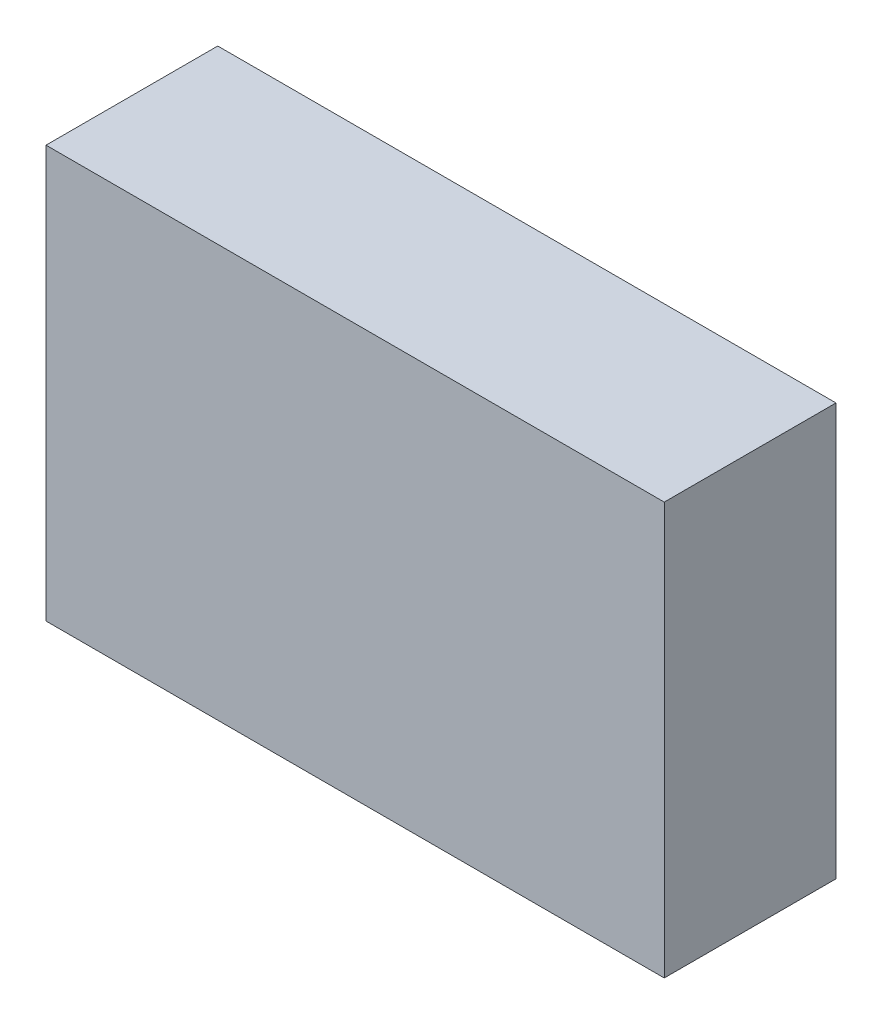
ISO-10303-21;
HEADER;
FILE_DESCRIPTION(('STEP AP214'),'2;1');
FILE_NAME('part.step','',(''),(''),'','','');
FILE_SCHEMA(('AUTOMOTIVE_DESIGN { 1 0 10303 214 1 1 1 1 }'));
ENDSEC;
DATA;
#1=APPLICATION_CONTEXT('core data for automotive mechanical design processes');
#2=APPLICATION_PROTOCOL_DEFINITION('international standard','automotive_design',2000,#1);
#3=PRODUCT_CONTEXT('',#1,'mechanical');
#4=PRODUCT('Part','Part','',(#3));
#5=PRODUCT_RELATED_PRODUCT_CATEGORY('part','',(#4));
#6=PRODUCT_DEFINITION_FORMATION('','',#4);
#7=PRODUCT_DEFINITION_CONTEXT('part definition',#1,'design');
#8=PRODUCT_DEFINITION('design','',#6,#7);
#9=PRODUCT_DEFINITION_SHAPE('','',#8);
#10=(LENGTH_UNIT() NAMED_UNIT(*) SI_UNIT(.MILLI.,.METRE.));
#11=(NAMED_UNIT(*) PLANE_ANGLE_UNIT() SI_UNIT($,.RADIAN.));
#12=(NAMED_UNIT(*) SI_UNIT($,.STERADIAN.) SOLID_ANGLE_UNIT());
#13=UNCERTAINTY_MEASURE_WITH_UNIT(LENGTH_MEASURE(1.E-05),#10,'distance_accuracy_value','');
#14=(GEOMETRIC_REPRESENTATION_CONTEXT(3) GLOBAL_UNCERTAINTY_ASSIGNED_CONTEXT((#13)) GLOBAL_UNIT_ASSIGNED_CONTEXT((#10,
#11,#12)) REPRESENTATION_CONTEXT('',''));
#15=CARTESIAN_POINT('',(0.,0.,0.));
#16=DIRECTION('',(0.,0.,1.));
#17=DIRECTION('',(1.,0.,0.));
#18=AXIS2_PLACEMENT_3D('',#15,#16,#17);
#19=CARTESIAN_POINT('',(0.,0.,25.));
#20=DIRECTION('',(1.,0.,0.));
#21=DIRECTION('',(0.,0.,-1.));
#22=AXIS2_PLACEMENT_3D('',#19,#20,#21);
#23=PLANE('',#22);
#24=DIRECTION('',(0.,-1.,0.));
#25=VECTOR('',#24,1.);
#26=CARTESIAN_POINT('',(0.,0.,0.));
#27=LINE('',#26,#25);
#28=CARTESIAN_POINT('',(0.,60.,0.));
#29=VERTEX_POINT('',#28);
#30=CARTESIAN_POINT('',(0.,0.,0.));
#31=VERTEX_POINT('',#30);
#32=EDGE_CURVE('E117',#29,#31,#27,.T.);
#33=ORIENTED_EDGE('',*,*,#32,.T.);
#34=DIRECTION('',(0.,0.,-1.));
#35=VECTOR('',#34,1.);
#36=CARTESIAN_POINT('',(0.,0.,25.));
#37=LINE('',#36,#35);
#38=CARTESIAN_POINT('',(0.,0.,25.));
#39=VERTEX_POINT('',#38);
#40=EDGE_CURVE('E11',#39,#31,#37,.T.);
#41=ORIENTED_EDGE('',*,*,#40,.F.);
#42=DIRECTION('',(0.,-1.,0.));
#43=VECTOR('',#42,1.);
#44=CARTESIAN_POINT('',(0.,0.,25.));
#45=LINE('',#44,#43);
#46=CARTESIAN_POINT('',(0.,60.,25.));
#47=VERTEX_POINT('',#46);
#48=EDGE_CURVE('E101',#47,#39,#45,.T.);
#49=ORIENTED_EDGE('',*,*,#48,.F.);
#50=DIRECTION('',(0.,0.,-1.));
#51=VECTOR('',#50,1.);
#52=CARTESIAN_POINT('',(0.,60.,25.));
#53=LINE('',#52,#51);
#54=EDGE_CURVE('E113',#47,#29,#53,.T.);
#55=ORIENTED_EDGE('',*,*,#54,.T.);
#56=EDGE_LOOP('',(#33,#41,#49,#55));
#57=FACE_BOUND('',#56,.T.);
#58=ADVANCED_FACE('F49',(#57),#23,.F.);
#59=CARTESIAN_POINT('',(0.,0.,25.));
#60=DIRECTION('',(0.,1.,0.));
#61=DIRECTION('',(0.,0.,1.));
#62=AXIS2_PLACEMENT_3D('',#59,#60,#61);
#63=PLANE('',#62);
#64=DIRECTION('',(1.,0.,0.));
#65=VECTOR('',#64,1.);
#66=CARTESIAN_POINT('',(0.,0.,0.));
#67=LINE('',#66,#65);
#68=CARTESIAN_POINT('',(90.,0.,0.));
#69=VERTEX_POINT('',#68);
#70=EDGE_CURVE('E106',#31,#69,#67,.T.);
#71=ORIENTED_EDGE('',*,*,#70,.T.);
#72=DIRECTION('',(0.,0.,-1.));
#73=VECTOR('',#72,1.);
#74=CARTESIAN_POINT('',(90.,0.,25.));
#75=LINE('',#74,#73);
#76=CARTESIAN_POINT('',(90.,0.,25.));
#77=VERTEX_POINT('',#76);
#78=EDGE_CURVE('E58',#77,#69,#75,.T.);
#79=ORIENTED_EDGE('',*,*,#78,.F.);
#80=DIRECTION('',(1.,0.,0.));
#81=VECTOR('',#80,1.);
#82=CARTESIAN_POINT('',(0.,0.,25.));
#83=LINE('',#82,#81);
#84=EDGE_CURVE('E96',#39,#77,#83,.T.);
#85=ORIENTED_EDGE('',*,*,#84,.F.);
#86=ORIENTED_EDGE('',*,*,#40,.T.);
#87=EDGE_LOOP('',(#71,#79,#85,#86));
#88=FACE_BOUND('',#87,.T.);
#89=ADVANCED_FACE('F105',(#88),#63,.F.);
#90=CARTESIAN_POINT('',(90.,0.,25.));
#91=DIRECTION('',(-1.,0.,0.));
#92=DIRECTION('',(0.,0.,1.));
#93=AXIS2_PLACEMENT_3D('',#90,#91,#92);
#94=PLANE('',#93);
#95=DIRECTION('',(0.,1.,0.));
#96=VECTOR('',#95,1.);
#97=CARTESIAN_POINT('',(90.,0.,0.));
#98=LINE('',#97,#96);
#99=CARTESIAN_POINT('',(90.,60.,0.));
#100=VERTEX_POINT('',#99);
#101=EDGE_CURVE('E83',#69,#100,#98,.T.);
#102=ORIENTED_EDGE('',*,*,#101,.T.);
#103=DIRECTION('',(0.,0.,-1.));
#104=VECTOR('',#103,1.);
#105=CARTESIAN_POINT('',(90.,60.,25.));
#106=LINE('',#105,#104);
#107=CARTESIAN_POINT('',(90.,60.,25.));
#108=VERTEX_POINT('',#107);
#109=EDGE_CURVE('E108',#108,#100,#106,.T.);
#110=ORIENTED_EDGE('',*,*,#109,.F.);
#111=DIRECTION('',(0.,1.,0.));
#112=VECTOR('',#111,1.);
#113=CARTESIAN_POINT('',(90.,0.,25.));
#114=LINE('',#113,#112);
#115=EDGE_CURVE('E99',#77,#108,#114,.T.);
#116=ORIENTED_EDGE('',*,*,#115,.F.);
#117=ORIENTED_EDGE('',*,*,#78,.T.);
#118=EDGE_LOOP('',(#102,#110,#116,#117));
#119=FACE_BOUND('',#118,.T.);
#120=ADVANCED_FACE('F109',(#119),#94,.F.);
#121=CARTESIAN_POINT('',(0.,60.,25.));
#122=DIRECTION('',(0.,-1.,0.));
#123=DIRECTION('',(0.,0.,-1.));
#124=AXIS2_PLACEMENT_3D('',#121,#122,#123);
#125=PLANE('',#124);
#126=DIRECTION('',(-1.,0.,0.));
#127=VECTOR('',#126,1.);
#128=CARTESIAN_POINT('',(0.,60.,0.));
#129=LINE('',#128,#127);
#130=EDGE_CURVE('E89',#100,#29,#129,.T.);
#131=ORIENTED_EDGE('',*,*,#130,.T.);
#132=ORIENTED_EDGE('',*,*,#54,.F.);
#133=DIRECTION('',(-1.,0.,0.));
#134=VECTOR('',#133,1.);
#135=CARTESIAN_POINT('',(0.,60.,25.));
#136=LINE('',#135,#134);
#137=EDGE_CURVE('E66',#108,#47,#136,.T.);
#138=ORIENTED_EDGE('',*,*,#137,.F.);
#139=ORIENTED_EDGE('',*,*,#109,.T.);
#140=EDGE_LOOP('',(#131,#132,#138,#139));
#141=FACE_BOUND('',#140,.T.);
#142=ADVANCED_FACE('F130',(#141),#125,.F.);
#143=CARTESIAN_POINT('',(0.,0.,25.));
#144=DIRECTION('',(0.,0.,-1.));
#145=DIRECTION('',(-1.,0.,0.));
#146=AXIS2_PLACEMENT_3D('',#143,#144,#145);
#147=PLANE('',#146);
#148=ORIENTED_EDGE('',*,*,#48,.T.);
#149=ORIENTED_EDGE('',*,*,#84,.T.);
#150=ORIENTED_EDGE('',*,*,#115,.T.);
#151=ORIENTED_EDGE('',*,*,#137,.T.);
#152=EDGE_LOOP('',(#148,#149,#150,#151));
#153=FACE_BOUND('',#152,.T.);
#154=ADVANCED_FACE('F97',(#153),#147,.F.);
#155=CARTESIAN_POINT('',(0.,0.,0.));
#156=DIRECTION('',(0.,0.,-1.));
#157=DIRECTION('',(-1.,0.,0.));
#158=AXIS2_PLACEMENT_3D('',#155,#156,#157);
#159=PLANE('',#158);
#160=ORIENTED_EDGE('',*,*,#32,.F.);
#161=ORIENTED_EDGE('',*,*,#130,.F.);
#162=ORIENTED_EDGE('',*,*,#101,.F.);
#163=ORIENTED_EDGE('',*,*,#70,.F.);
#164=EDGE_LOOP('',(#160,#161,#162,#163));
#165=FACE_BOUND('',#164,.T.);
#166=ADVANCED_FACE('F133',(#165),#159,.T.);
#167=CLOSED_SHELL('',(#58,#89,#120,#142,#154,#166));
#168=MANIFOLD_SOLID_BREP('B2',#167);
#169=ADVANCED_BREP_SHAPE_REPRESENTATION('',(#18,#168),#14);
#170=SHAPE_DEFINITION_REPRESENTATION(#9,#169);
ENDSEC;
END-ISO-10303-21;
